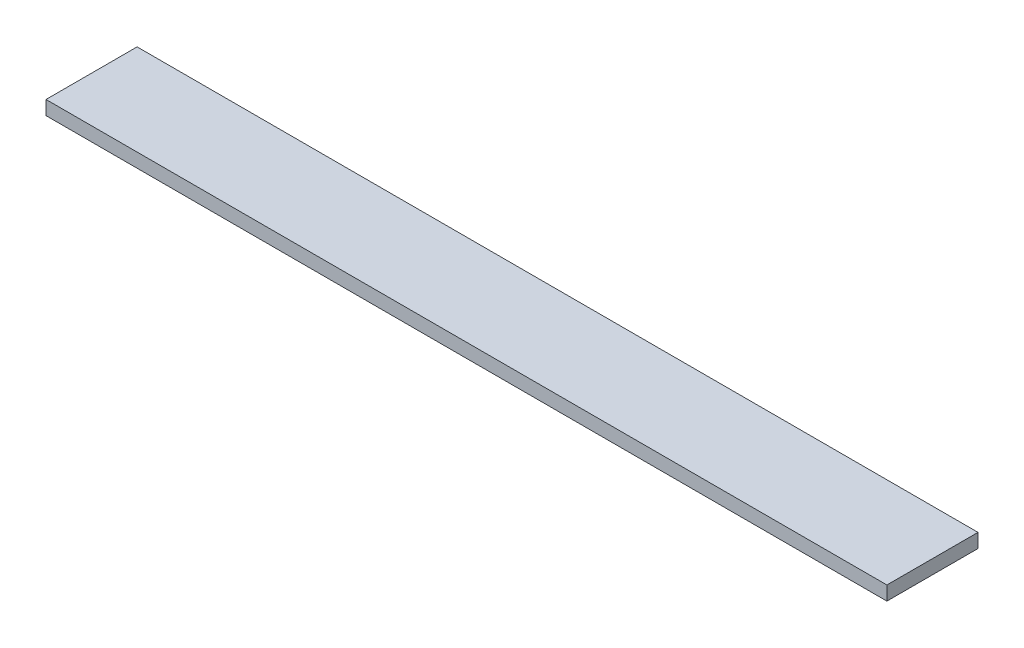
ISO-10303-21;
HEADER;
FILE_DESCRIPTION(('STEP AP214'),'2;1');
FILE_NAME('part.step','',(''),(''),'','','');
FILE_SCHEMA(('AUTOMOTIVE_DESIGN { 1 0 10303 214 1 1 1 1 }'));
ENDSEC;
DATA;
#1=APPLICATION_CONTEXT('core data for automotive mechanical design processes');
#2=APPLICATION_PROTOCOL_DEFINITION('international standard','automotive_design',2000,#1);
#3=PRODUCT_CONTEXT('',#1,'mechanical');
#4=PRODUCT('Part','Part','',(#3));
#5=PRODUCT_RELATED_PRODUCT_CATEGORY('part','',(#4));
#6=PRODUCT_DEFINITION_FORMATION('','',#4);
#7=PRODUCT_DEFINITION_CONTEXT('part definition',#1,'design');
#8=PRODUCT_DEFINITION('design','',#6,#7);
#9=PRODUCT_DEFINITION_SHAPE('','',#8);
#10=(LENGTH_UNIT() NAMED_UNIT(*) SI_UNIT(.MILLI.,.METRE.));
#11=(NAMED_UNIT(*) PLANE_ANGLE_UNIT() SI_UNIT($,.RADIAN.));
#12=(NAMED_UNIT(*) SI_UNIT($,.STERADIAN.) SOLID_ANGLE_UNIT());
#13=UNCERTAINTY_MEASURE_WITH_UNIT(LENGTH_MEASURE(1.E-05),#10,'distance_accuracy_value','');
#14=(GEOMETRIC_REPRESENTATION_CONTEXT(3) GLOBAL_UNCERTAINTY_ASSIGNED_CONTEXT((#13)) GLOBAL_UNIT_ASSIGNED_CONTEXT((#10,
#11,#12)) REPRESENTATION_CONTEXT('',''));
#15=CARTESIAN_POINT('',(0.,0.,0.));
#16=DIRECTION('',(0.,0.,1.));
#17=DIRECTION('',(1.,0.,0.));
#18=AXIS2_PLACEMENT_3D('',#15,#16,#17);
#19=CARTESIAN_POINT('',(-93.2215388477469,12.7,-49.4557692146772));
#20=DIRECTION('',(1.,0.,0.));
#21=DIRECTION('',(0.,0.,-1.));
#22=AXIS2_PLACEMENT_3D('',#19,#20,#21);
#23=PLANE('',#22);
#24=DIRECTION('',(0.,0.,1.));
#25=VECTOR('',#24,1.);
#26=CARTESIAN_POINT('',(-93.2215388477469,0.,-49.4557692146772));
#27=LINE('',#26,#25);
#28=CARTESIAN_POINT('',(-93.2215388477469,0.,-49.4557692146772));
#29=VERTEX_POINT('',#28);
#30=CARTESIAN_POINT('',(-93.2215388477469,0.,33.0942307853228));
#31=VERTEX_POINT('',#30);
#32=EDGE_CURVE('E94',#29,#31,#27,.T.);
#33=ORIENTED_EDGE('',*,*,#32,.T.);
#34=DIRECTION('',(0.,-1.,0.));
#35=VECTOR('',#34,1.);
#36=CARTESIAN_POINT('',(-93.2215388477469,12.7,33.0942307853228));
#37=LINE('',#36,#35);
#38=CARTESIAN_POINT('',(-93.2215388477469,12.7,33.0942307853228));
#39=VERTEX_POINT('',#38);
#40=EDGE_CURVE('E11',#39,#31,#37,.T.);
#41=ORIENTED_EDGE('',*,*,#40,.F.);
#42=DIRECTION('',(0.,0.,1.));
#43=VECTOR('',#42,1.);
#44=CARTESIAN_POINT('',(-93.2215388477469,12.7,-49.4557692146772));
#45=LINE('',#44,#43);
#46=CARTESIAN_POINT('',(-93.2215388477469,12.7,-49.4557692146772));
#47=VERTEX_POINT('',#46);
#48=EDGE_CURVE('E82',#47,#39,#45,.T.);
#49=ORIENTED_EDGE('',*,*,#48,.F.);
#50=DIRECTION('',(0.,-1.,0.));
#51=VECTOR('',#50,1.);
#52=CARTESIAN_POINT('',(-93.2215388477469,12.7,-49.4557692146772));
#53=LINE('',#52,#51);
#54=EDGE_CURVE('E90',#47,#29,#53,.T.);
#55=ORIENTED_EDGE('',*,*,#54,.T.);
#56=EDGE_LOOP('',(#33,#41,#49,#55));
#57=FACE_BOUND('',#56,.T.);
#58=ADVANCED_FACE('F31',(#57),#23,.F.);
#59=CARTESIAN_POINT('',(-93.2215388477469,12.7,33.0942307853228));
#60=DIRECTION('',(0.,0.,-1.));
#61=DIRECTION('',(-1.,0.,0.));
#62=AXIS2_PLACEMENT_3D('',#59,#60,#61);
#63=PLANE('',#62);
#64=DIRECTION('',(1.,0.,0.));
#65=VECTOR('',#64,1.);
#66=CARTESIAN_POINT('',(-93.2215388477469,0.,33.0942307853228));
#67=LINE('',#66,#65);
#68=CARTESIAN_POINT('',(668.778461152253,0.,33.0942307853228));
#69=VERTEX_POINT('',#68);
#70=EDGE_CURVE('E86',#31,#69,#67,.T.);
#71=ORIENTED_EDGE('',*,*,#70,.T.);
#72=DIRECTION('',(0.,-1.,0.));
#73=VECTOR('',#72,1.);
#74=CARTESIAN_POINT('',(668.778461152253,12.7,33.0942307853228));
#75=LINE('',#74,#73);
#76=CARTESIAN_POINT('',(668.778461152253,12.7,33.0942307853228));
#77=VERTEX_POINT('',#76);
#78=EDGE_CURVE('E39',#77,#69,#75,.T.);
#79=ORIENTED_EDGE('',*,*,#78,.F.);
#80=DIRECTION('',(1.,0.,0.));
#81=VECTOR('',#80,1.);
#82=CARTESIAN_POINT('',(-93.2215388477469,12.7,33.0942307853228));
#83=LINE('',#82,#81);
#84=EDGE_CURVE('E77',#39,#77,#83,.T.);
#85=ORIENTED_EDGE('',*,*,#84,.F.);
#86=ORIENTED_EDGE('',*,*,#40,.T.);
#87=EDGE_LOOP('',(#71,#79,#85,#86));
#88=FACE_BOUND('',#87,.T.);
#89=ADVANCED_FACE('F85',(#88),#63,.F.);
#90=CARTESIAN_POINT('',(668.778461152253,12.7,-49.4557692146772));
#91=DIRECTION('',(-1.,0.,0.));
#92=DIRECTION('',(0.,0.,1.));
#93=AXIS2_PLACEMENT_3D('',#90,#91,#92);
#94=PLANE('',#93);
#95=DIRECTION('',(0.,0.,-1.));
#96=VECTOR('',#95,1.);
#97=CARTESIAN_POINT('',(668.778461152253,0.,-49.4557692146772));
#98=LINE('',#97,#96);
#99=CARTESIAN_POINT('',(668.778461152253,0.,-49.4557692146772));
#100=VERTEX_POINT('',#99);
#101=EDGE_CURVE('E64',#69,#100,#98,.T.);
#102=ORIENTED_EDGE('',*,*,#101,.T.);
#103=DIRECTION('',(0.,-1.,0.));
#104=VECTOR('',#103,1.);
#105=CARTESIAN_POINT('',(668.778461152253,12.7,-49.4557692146772));
#106=LINE('',#105,#104);
#107=CARTESIAN_POINT('',(668.778461152253,12.7,-49.4557692146772));
#108=VERTEX_POINT('',#107);
#109=EDGE_CURVE('E87',#108,#100,#106,.T.);
#110=ORIENTED_EDGE('',*,*,#109,.F.);
#111=DIRECTION('',(0.,0.,-1.));
#112=VECTOR('',#111,1.);
#113=CARTESIAN_POINT('',(668.778461152253,12.7,-49.4557692146772));
#114=LINE('',#113,#112);
#115=EDGE_CURVE('E80',#77,#108,#114,.T.);
#116=ORIENTED_EDGE('',*,*,#115,.F.);
#117=ORIENTED_EDGE('',*,*,#78,.T.);
#118=EDGE_LOOP('',(#102,#110,#116,#117));
#119=FACE_BOUND('',#118,.T.);
#120=ADVANCED_FACE('F88',(#119),#94,.F.);
#121=CARTESIAN_POINT('',(-93.2215388477469,12.7,-49.4557692146772));
#122=DIRECTION('',(0.,0.,1.));
#123=DIRECTION('',(1.,0.,0.));
#124=AXIS2_PLACEMENT_3D('',#121,#122,#123);
#125=PLANE('',#124);
#126=DIRECTION('',(-1.,0.,0.));
#127=VECTOR('',#126,1.);
#128=CARTESIAN_POINT('',(-93.2215388477469,0.,-49.4557692146772));
#129=LINE('',#128,#127);
#130=EDGE_CURVE('E70',#100,#29,#129,.T.);
#131=ORIENTED_EDGE('',*,*,#130,.T.);
#132=ORIENTED_EDGE('',*,*,#54,.F.);
#133=DIRECTION('',(-1.,0.,0.));
#134=VECTOR('',#133,1.);
#135=CARTESIAN_POINT('',(-93.2215388477469,12.7,-49.4557692146772));
#136=LINE('',#135,#134);
#137=EDGE_CURVE('E47',#108,#47,#136,.T.);
#138=ORIENTED_EDGE('',*,*,#137,.F.);
#139=ORIENTED_EDGE('',*,*,#109,.T.);
#140=EDGE_LOOP('',(#131,#132,#138,#139));
#141=FACE_BOUND('',#140,.T.);
#142=ADVANCED_FACE('F101',(#141),#125,.F.);
#143=CARTESIAN_POINT('',(-93.2215388477469,12.7,33.0942307853228));
#144=DIRECTION('',(0.,1.,0.));
#145=DIRECTION('',(0.,0.,1.));
#146=AXIS2_PLACEMENT_3D('',#143,#144,#145);
#147=PLANE('',#146);
#148=ORIENTED_EDGE('',*,*,#48,.T.);
#149=ORIENTED_EDGE('',*,*,#84,.T.);
#150=ORIENTED_EDGE('',*,*,#115,.T.);
#151=ORIENTED_EDGE('',*,*,#137,.T.);
#152=EDGE_LOOP('',(#148,#149,#150,#151));
#153=FACE_BOUND('',#152,.T.);
#154=ADVANCED_FACE('F78',(#153),#147,.T.);
#155=CARTESIAN_POINT('',(-93.2215388477469,0.,33.0942307853228));
#156=DIRECTION('',(0.,1.,0.));
#157=DIRECTION('',(0.,0.,1.));
#158=AXIS2_PLACEMENT_3D('',#155,#156,#157);
#159=PLANE('',#158);
#160=ORIENTED_EDGE('',*,*,#32,.F.);
#161=ORIENTED_EDGE('',*,*,#130,.F.);
#162=ORIENTED_EDGE('',*,*,#101,.F.);
#163=ORIENTED_EDGE('',*,*,#70,.F.);
#164=EDGE_LOOP('',(#160,#161,#162,#163));
#165=FACE_BOUND('',#164,.T.);
#166=ADVANCED_FACE('F104',(#165),#159,.F.);
#167=CLOSED_SHELL('',(#58,#89,#120,#142,#154,#166));
#168=MANIFOLD_SOLID_BREP('B2',#167);
#169=ADVANCED_BREP_SHAPE_REPRESENTATION('',(#18,#168),#14);
#170=SHAPE_DEFINITION_REPRESENTATION(#9,#169);
ENDSEC;
END-ISO-10303-21;
